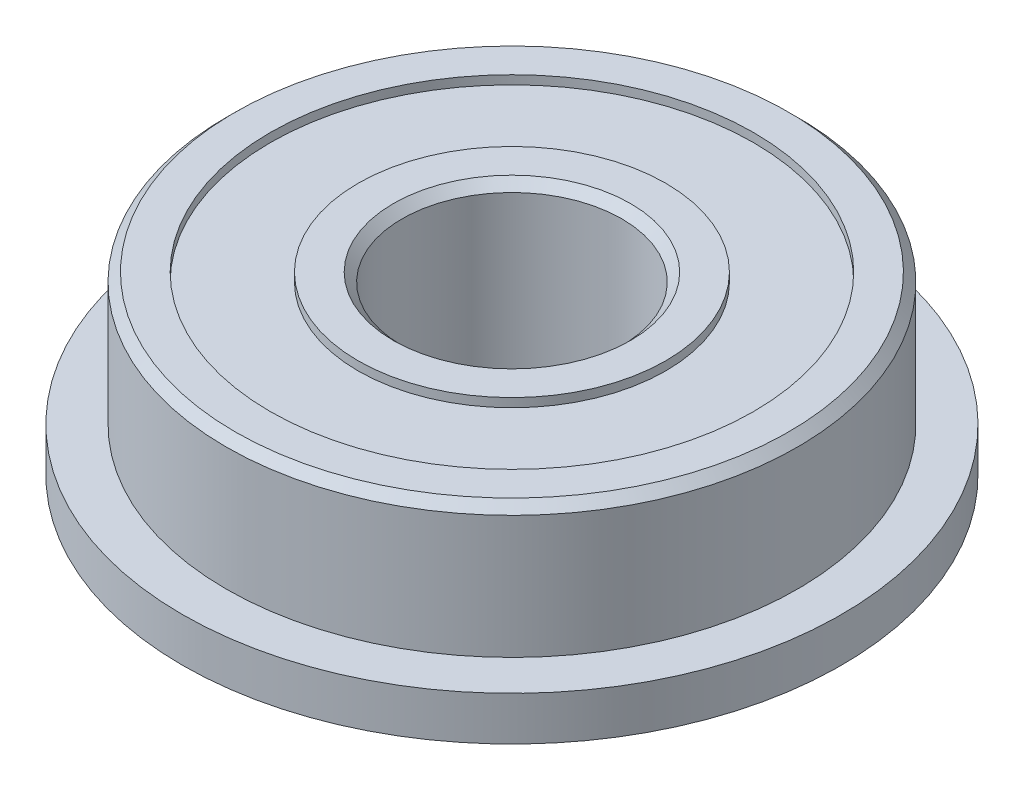
ISO-10303-21;
HEADER;
FILE_DESCRIPTION(('STEP AP214'),'2;1');
FILE_NAME('part.step','',(''),(''),'','','');
FILE_SCHEMA(('AUTOMOTIVE_DESIGN { 1 0 10303 214 1 1 1 1 }'));
ENDSEC;
DATA;
#1=APPLICATION_CONTEXT('core data for automotive mechanical design processes');
#2=APPLICATION_PROTOCOL_DEFINITION('international standard','automotive_design',2000,#1);
#3=PRODUCT_CONTEXT('',#1,'mechanical');
#4=PRODUCT('Part','Part','',(#3));
#5=PRODUCT_RELATED_PRODUCT_CATEGORY('part','',(#4));
#6=PRODUCT_DEFINITION_FORMATION('','',#4);
#7=PRODUCT_DEFINITION_CONTEXT('part definition',#1,'design');
#8=PRODUCT_DEFINITION('design','',#6,#7);
#9=PRODUCT_DEFINITION_SHAPE('','',#8);
#10=(LENGTH_UNIT() NAMED_UNIT(*) SI_UNIT(.MILLI.,.METRE.));
#11=(NAMED_UNIT(*) PLANE_ANGLE_UNIT() SI_UNIT($,.RADIAN.));
#12=(NAMED_UNIT(*) SI_UNIT($,.STERADIAN.) SOLID_ANGLE_UNIT());
#13=UNCERTAINTY_MEASURE_WITH_UNIT(LENGTH_MEASURE(1.E-05),#10,'distance_accuracy_value','');
#14=(GEOMETRIC_REPRESENTATION_CONTEXT(3) GLOBAL_UNCERTAINTY_ASSIGNED_CONTEXT((#13)) GLOBAL_UNIT_ASSIGNED_CONTEXT((#10,
#11,#12)) REPRESENTATION_CONTEXT('',''));
#15=CARTESIAN_POINT('',(0.,0.,0.));
#16=DIRECTION('',(0.,0.,1.));
#17=DIRECTION('',(1.,0.,0.));
#18=AXIS2_PLACEMENT_3D('',#15,#16,#17);
#19=CARTESIAN_POINT('',(-2.5,0.,0.));
#20=DIRECTION('',(0.,-1.,0.));
#21=DIRECTION('',(0.,0.,-1.));
#22=AXIS2_PLACEMENT_3D('',#19,#20,#21);
#23=PLANE('',#22);
#24=CARTESIAN_POINT('',(0.,0.,0.));
#25=DIRECTION('',(0.,-1.,0.));
#26=DIRECTION('',(0.,0.,-1.));
#27=AXIS2_PLACEMENT_3D('',#24,#25,#26);
#28=CIRCLE('',#27,2.7);
#29=CARTESIAN_POINT('',(0.,0.,-2.7));
#30=VERTEX_POINT('',#29);
#31=EDGE_CURVE('E70',#30,#30,#28,.F.);
#32=ORIENTED_EDGE('',*,*,#31,.T.);
#33=EDGE_LOOP('',(#32));
#34=FACE_BOUND('',#33,.T.);
#35=CARTESIAN_POINT('',(0.,0.,0.));
#36=DIRECTION('',(0.,1.,0.));
#37=DIRECTION('',(0.,0.,1.));
#38=AXIS2_PLACEMENT_3D('',#35,#36,#37);
#39=CIRCLE('',#38,3.5);
#40=CARTESIAN_POINT('',(0.,0.,3.5));
#41=VERTEX_POINT('',#40);
#42=EDGE_CURVE('E111',#41,#41,#39,.T.);
#43=ORIENTED_EDGE('',*,*,#42,.F.);
#44=EDGE_LOOP('',(#43));
#45=FACE_BOUND('',#44,.T.);
#46=ADVANCED_FACE('F41',(#34,#45),#23,.T.);
#47=CARTESIAN_POINT('',(-6.5,4.,0.));
#48=DIRECTION('',(0.,1.,0.));
#49=DIRECTION('',(0.,0.,1.));
#50=AXIS2_PLACEMENT_3D('',#47,#48,#49);
#51=PLANE('',#50);
#52=CARTESIAN_POINT('',(0.,4.,0.));
#53=DIRECTION('',(0.,1.,0.));
#54=DIRECTION('',(0.,0.,1.));
#55=AXIS2_PLACEMENT_3D('',#52,#53,#54);
#56=CIRCLE('',#55,2.7);
#57=CARTESIAN_POINT('',(0.,4.,2.7));
#58=VERTEX_POINT('',#57);
#59=EDGE_CURVE('E55',#58,#58,#56,.F.);
#60=ORIENTED_EDGE('',*,*,#59,.T.);
#61=EDGE_LOOP('',(#60));
#62=FACE_BOUND('',#61,.T.);
#63=CARTESIAN_POINT('',(0.,4.,0.));
#64=DIRECTION('',(0.,1.,0.));
#65=DIRECTION('',(0.,0.,1.));
#66=AXIS2_PLACEMENT_3D('',#63,#64,#65);
#67=CIRCLE('',#66,3.5);
#68=CARTESIAN_POINT('',(0.,4.,3.5));
#69=VERTEX_POINT('',#68);
#70=EDGE_CURVE('E95',#69,#69,#67,.T.);
#71=ORIENTED_EDGE('',*,*,#70,.T.);
#72=EDGE_LOOP('',(#71));
#73=FACE_BOUND('',#72,.T.);
#74=ADVANCED_FACE('F130',(#62,#73),#51,.T.);
#75=CARTESIAN_POINT('',(0.,1.92162386661865,0.));
#76=DIRECTION('',(0.,1.,0.));
#77=DIRECTION('',(0.,0.,1.));
#78=AXIS2_PLACEMENT_3D('',#75,#76,#77);
#79=CYLINDRICAL_SURFACE('',#78,6.5);
#80=CARTESIAN_POINT('',(0.,3.8,0.));
#81=DIRECTION('',(0.,1.,0.));
#82=DIRECTION('',(0.,0.,1.));
#83=AXIS2_PLACEMENT_3D('',#80,#81,#82);
#84=CIRCLE('',#83,6.5);
#85=CARTESIAN_POINT('',(0.,3.8,6.5));
#86=VERTEX_POINT('',#85);
#87=EDGE_CURVE('E10',#86,#86,#84,.F.);
#88=ORIENTED_EDGE('',*,*,#87,.T.);
#89=EDGE_LOOP('',(#88));
#90=FACE_BOUND('',#89,.T.);
#91=CARTESIAN_POINT('',(0.,1.,0.));
#92=DIRECTION('',(0.,1.,0.));
#93=DIRECTION('',(0.,0.,1.));
#94=AXIS2_PLACEMENT_3D('',#91,#92,#93);
#95=CIRCLE('',#94,6.5);
#96=CARTESIAN_POINT('',(0.,1.,6.5));
#97=VERTEX_POINT('',#96);
#98=EDGE_CURVE('E82',#97,#97,#95,.T.);
#99=ORIENTED_EDGE('',*,*,#98,.T.);
#100=EDGE_LOOP('',(#99));
#101=FACE_BOUND('',#100,.T.);
#102=ADVANCED_FACE('F137',(#90,#101),#79,.T.);
#103=CARTESIAN_POINT('',(0.,4.,0.));
#104=DIRECTION('',(0.,1.,0.));
#105=DIRECTION('',(0.,0.,1.));
#106=AXIS2_PLACEMENT_3D('',#103,#104,#105);
#107=CIRCLE('',#106,6.3);
#108=CARTESIAN_POINT('',(0.,4.,6.3));
#109=VERTEX_POINT('',#108);
#110=EDGE_CURVE('E50',#109,#109,#107,.T.);
#111=ORIENTED_EDGE('',*,*,#110,.T.);
#112=EDGE_LOOP('',(#111));
#113=FACE_BOUND('',#112,.T.);
#114=CARTESIAN_POINT('',(0.,4.,0.));
#115=DIRECTION('',(0.,1.,0.));
#116=DIRECTION('',(0.,0.,1.));
#117=AXIS2_PLACEMENT_3D('',#114,#115,#116);
#118=CIRCLE('',#117,5.5);
#119=CARTESIAN_POINT('',(0.,4.,5.5));
#120=VERTEX_POINT('',#119);
#121=EDGE_CURVE('E87',#120,#120,#118,.T.);
#122=ORIENTED_EDGE('',*,*,#121,.F.);
#123=EDGE_LOOP('',(#122));
#124=FACE_BOUND('',#123,.T.);
#125=ADVANCED_FACE('F140',(#113,#124),#51,.T.);
#126=CARTESIAN_POINT('',(0.,1.92162386661865,0.));
#127=DIRECTION('',(0.,1.,0.));
#128=DIRECTION('',(0.,0.,1.));
#129=AXIS2_PLACEMENT_3D('',#126,#127,#128);
#130=CYLINDRICAL_SURFACE('',#129,2.5);
#131=CARTESIAN_POINT('',(0.,0.199999999999997,0.));
#132=DIRECTION('',(0.,-1.,0.));
#133=DIRECTION('',(0.,0.,-1.));
#134=AXIS2_PLACEMENT_3D('',#131,#132,#133);
#135=CIRCLE('',#134,2.5);
#136=CARTESIAN_POINT('',(0.,0.199999999999997,-2.5));
#137=VERTEX_POINT('',#136);
#138=EDGE_CURVE('E60',#137,#137,#135,.T.);
#139=ORIENTED_EDGE('',*,*,#138,.T.);
#140=EDGE_LOOP('',(#139));
#141=FACE_BOUND('',#140,.T.);
#142=CARTESIAN_POINT('',(0.,3.8,0.));
#143=DIRECTION('',(0.,1.,0.));
#144=DIRECTION('',(0.,0.,1.));
#145=AXIS2_PLACEMENT_3D('',#142,#143,#144);
#146=CIRCLE('',#145,2.5);
#147=CARTESIAN_POINT('',(0.,3.8,2.5));
#148=VERTEX_POINT('',#147);
#149=EDGE_CURVE('E66',#148,#148,#146,.T.);
#150=ORIENTED_EDGE('',*,*,#149,.T.);
#151=EDGE_LOOP('',(#150));
#152=FACE_BOUND('',#151,.T.);
#153=ADVANCED_FACE('F145',(#141,#152),#130,.F.);
#154=CARTESIAN_POINT('',(0.,0.,0.));
#155=DIRECTION('',(0.,1.,0.));
#156=DIRECTION('',(0.,0.,1.));
#157=AXIS2_PLACEMENT_3D('',#154,#155,#156);
#158=CIRCLE('',#157,5.5);
#159=CARTESIAN_POINT('',(0.,0.,5.5));
#160=VERTEX_POINT('',#159);
#161=EDGE_CURVE('E103',#160,#160,#158,.T.);
#162=ORIENTED_EDGE('',*,*,#161,.T.);
#163=EDGE_LOOP('',(#162));
#164=FACE_BOUND('',#163,.T.);
#165=CARTESIAN_POINT('',(0.,0.,0.));
#166=DIRECTION('',(0.,1.,0.));
#167=DIRECTION('',(0.,0.,1.));
#168=AXIS2_PLACEMENT_3D('',#165,#166,#167);
#169=CIRCLE('',#168,7.5);
#170=CARTESIAN_POINT('',(0.,0.,7.5));
#171=VERTEX_POINT('',#170);
#172=EDGE_CURVE('E74',#171,#171,#169,.T.);
#173=ORIENTED_EDGE('',*,*,#172,.F.);
#174=EDGE_LOOP('',(#173));
#175=FACE_BOUND('',#174,.T.);
#176=ADVANCED_FACE('F133',(#164,#175),#23,.T.);
#177=CARTESIAN_POINT('',(0.,1.92162386661865,0.));
#178=DIRECTION('',(0.,1.,0.));
#179=DIRECTION('',(0.,0.,1.));
#180=AXIS2_PLACEMENT_3D('',#177,#178,#179);
#181=CYLINDRICAL_SURFACE('',#180,7.5);
#182=ORIENTED_EDGE('',*,*,#172,.T.);
#183=EDGE_LOOP('',(#182));
#184=FACE_BOUND('',#183,.T.);
#185=CARTESIAN_POINT('',(0.,0.999999999999999,0.));
#186=DIRECTION('',(0.,1.,0.));
#187=DIRECTION('',(0.,0.,1.));
#188=AXIS2_PLACEMENT_3D('',#185,#186,#187);
#189=CIRCLE('',#188,7.5);
#190=CARTESIAN_POINT('',(0.,0.999999999999999,7.5));
#191=VERTEX_POINT('',#190);
#192=EDGE_CURVE('E78',#191,#191,#189,.T.);
#193=ORIENTED_EDGE('',*,*,#192,.F.);
#194=EDGE_LOOP('',(#193));
#195=FACE_BOUND('',#194,.T.);
#196=ADVANCED_FACE('F144',(#184,#195),#181,.T.);
#197=CARTESIAN_POINT('',(-6.5,1.,0.));
#198=DIRECTION('',(0.,1.,0.));
#199=DIRECTION('',(0.,0.,1.));
#200=AXIS2_PLACEMENT_3D('',#197,#198,#199);
#201=PLANE('',#200);
#202=ORIENTED_EDGE('',*,*,#192,.T.);
#203=EDGE_LOOP('',(#202));
#204=FACE_BOUND('',#203,.T.);
#205=ORIENTED_EDGE('',*,*,#98,.F.);
#206=EDGE_LOOP('',(#205));
#207=FACE_BOUND('',#206,.T.);
#208=ADVANCED_FACE('F151',(#204,#207),#201,.T.);
#209=CARTESIAN_POINT('',(0.,3.8,0.));
#210=DIRECTION('',(0.,1.,0.));
#211=DIRECTION('',(0.,0.,1.));
#212=AXIS2_PLACEMENT_3D('',#209,#210,#211);
#213=CYLINDRICAL_SURFACE('',#212,5.5);
#214=CARTESIAN_POINT('',(0.,3.8,0.));
#215=DIRECTION('',(0.,1.,0.));
#216=DIRECTION('',(0.,0.,1.));
#217=AXIS2_PLACEMENT_3D('',#214,#215,#216);
#218=CIRCLE('',#217,5.5);
#219=CARTESIAN_POINT('',(0.,3.8,5.5));
#220=VERTEX_POINT('',#219);
#221=EDGE_CURVE('E86',#220,#220,#218,.T.);
#222=ORIENTED_EDGE('',*,*,#221,.F.);
#223=EDGE_LOOP('',(#222));
#224=FACE_BOUND('',#223,.T.);
#225=ORIENTED_EDGE('',*,*,#121,.T.);
#226=EDGE_LOOP('',(#225));
#227=FACE_BOUND('',#226,.T.);
#228=ADVANCED_FACE('F162',(#224,#227),#213,.F.);
#229=CARTESIAN_POINT('',(0.,3.8,0.));
#230=DIRECTION('',(0.,1.,0.));
#231=DIRECTION('',(0.,0.,1.));
#232=AXIS2_PLACEMENT_3D('',#229,#230,#231);
#233=PLANE('',#232);
#234=CARTESIAN_POINT('',(0.,3.8,0.));
#235=DIRECTION('',(0.,1.,0.));
#236=DIRECTION('',(0.,0.,1.));
#237=AXIS2_PLACEMENT_3D('',#234,#235,#236);
#238=CIRCLE('',#237,3.5);
#239=CARTESIAN_POINT('',(0.,3.8,3.5));
#240=VERTEX_POINT('',#239);
#241=EDGE_CURVE('E91',#240,#240,#238,.T.);
#242=ORIENTED_EDGE('',*,*,#241,.F.);
#243=EDGE_LOOP('',(#242));
#244=FACE_BOUND('',#243,.T.);
#245=ORIENTED_EDGE('',*,*,#221,.T.);
#246=EDGE_LOOP('',(#245));
#247=FACE_BOUND('',#246,.T.);
#248=ADVANCED_FACE('F196',(#244,#247),#233,.T.);
#249=CARTESIAN_POINT('',(0.,3.8,0.));
#250=DIRECTION('',(0.,1.,0.));
#251=DIRECTION('',(0.,0.,1.));
#252=AXIS2_PLACEMENT_3D('',#249,#250,#251);
#253=CYLINDRICAL_SURFACE('',#252,3.5);
#254=ORIENTED_EDGE('',*,*,#241,.T.);
#255=EDGE_LOOP('',(#254));
#256=FACE_BOUND('',#255,.T.);
#257=ORIENTED_EDGE('',*,*,#70,.F.);
#258=EDGE_LOOP('',(#257));
#259=FACE_BOUND('',#258,.T.);
#260=ADVANCED_FACE('F194',(#256,#259),#253,.T.);
#261=CARTESIAN_POINT('',(0.,0.2,0.));
#262=DIRECTION('',(0.,-1.,0.));
#263=DIRECTION('',(0.,0.,1.));
#264=AXIS2_PLACEMENT_3D('',#261,#262,#263);
#265=PLANE('',#264);
#266=CARTESIAN_POINT('',(0.,0.2,0.));
#267=DIRECTION('',(0.,1.,0.));
#268=DIRECTION('',(0.,0.,1.));
#269=AXIS2_PLACEMENT_3D('',#266,#267,#268);
#270=CIRCLE('',#269,5.5);
#271=CARTESIAN_POINT('',(0.,0.2,5.5));
#272=VERTEX_POINT('',#271);
#273=EDGE_CURVE('E99',#272,#272,#270,.T.);
#274=ORIENTED_EDGE('',*,*,#273,.F.);
#275=EDGE_LOOP('',(#274));
#276=FACE_BOUND('',#275,.T.);
#277=CARTESIAN_POINT('',(0.,0.2,0.));
#278=DIRECTION('',(0.,1.,0.));
#279=DIRECTION('',(0.,0.,1.));
#280=AXIS2_PLACEMENT_3D('',#277,#278,#279);
#281=CIRCLE('',#280,3.5);
#282=CARTESIAN_POINT('',(0.,0.2,3.5));
#283=VERTEX_POINT('',#282);
#284=EDGE_CURVE('E107',#283,#283,#281,.T.);
#285=ORIENTED_EDGE('',*,*,#284,.T.);
#286=EDGE_LOOP('',(#285));
#287=FACE_BOUND('',#286,.T.);
#288=ADVANCED_FACE('F119',(#276,#287),#265,.T.);
#289=CARTESIAN_POINT('',(0.,0.2,0.));
#290=DIRECTION('',(0.,-1.,0.));
#291=DIRECTION('',(0.,0.,-1.));
#292=AXIS2_PLACEMENT_3D('',#289,#290,#291);
#293=CYLINDRICAL_SURFACE('',#292,5.5);
#294=ORIENTED_EDGE('',*,*,#273,.T.);
#295=EDGE_LOOP('',(#294));
#296=FACE_BOUND('',#295,.T.);
#297=ORIENTED_EDGE('',*,*,#161,.F.);
#298=EDGE_LOOP('',(#297));
#299=FACE_BOUND('',#298,.T.);
#300=ADVANCED_FACE('F125',(#296,#299),#293,.F.);
#301=CARTESIAN_POINT('',(0.,0.2,0.));
#302=DIRECTION('',(0.,-1.,0.));
#303=DIRECTION('',(0.,0.,-1.));
#304=AXIS2_PLACEMENT_3D('',#301,#302,#303);
#305=CYLINDRICAL_SURFACE('',#304,3.5);
#306=ORIENTED_EDGE('',*,*,#284,.F.);
#307=EDGE_LOOP('',(#306));
#308=FACE_BOUND('',#307,.T.);
#309=ORIENTED_EDGE('',*,*,#42,.T.);
#310=EDGE_LOOP('',(#309));
#311=FACE_BOUND('',#310,.T.);
#312=ADVANCED_FACE('F121',(#308,#311),#305,.T.);
#313=CARTESIAN_POINT('',(0.,0.,0.));
#314=DIRECTION('',(0.,-1.,0.));
#315=DIRECTION('',(0.,0.,-1.));
#316=AXIS2_PLACEMENT_3D('',#313,#314,#315);
#317=CONICAL_SURFACE('',#316,2.7,0.785398163397447);
#318=ORIENTED_EDGE('',*,*,#138,.F.);
#319=EDGE_LOOP('',(#318));
#320=FACE_BOUND('',#319,.T.);
#321=ORIENTED_EDGE('',*,*,#31,.F.);
#322=EDGE_LOOP('',(#321));
#323=FACE_BOUND('',#322,.T.);
#324=ADVANCED_FACE('F124',(#320,#323),#317,.F.);
#325=CARTESIAN_POINT('',(0.,3.8,0.));
#326=DIRECTION('',(0.,1.,0.));
#327=DIRECTION('',(0.,0.,1.));
#328=AXIS2_PLACEMENT_3D('',#325,#326,#327);
#329=CONICAL_SURFACE('',#328,2.5,0.785398163397445);
#330=ORIENTED_EDGE('',*,*,#59,.F.);
#331=EDGE_LOOP('',(#330));
#332=FACE_BOUND('',#331,.T.);
#333=ORIENTED_EDGE('',*,*,#149,.F.);
#334=EDGE_LOOP('',(#333));
#335=FACE_BOUND('',#334,.T.);
#336=ADVANCED_FACE('F177',(#332,#335),#329,.F.);
#337=CARTESIAN_POINT('',(0.,4.,0.));
#338=DIRECTION('',(0.,-1.,0.));
#339=DIRECTION('',(0.,0.,-1.));
#340=AXIS2_PLACEMENT_3D('',#337,#338,#339);
#341=CONICAL_SURFACE('',#340,6.3,0.78539816339744);
#342=ORIENTED_EDGE('',*,*,#87,.F.);
#343=EDGE_LOOP('',(#342));
#344=FACE_BOUND('',#343,.T.);
#345=ORIENTED_EDGE('',*,*,#110,.F.);
#346=EDGE_LOOP('',(#345));
#347=FACE_BOUND('',#346,.T.);
#348=ADVANCED_FACE('F44',(#344,#347),#341,.T.);
#349=CLOSED_SHELL('',(#46,#74,#102,#125,#153,#176,#196,#208,#228,#248,#260,#288,#300,#312,#324,
#336,#348));
#350=MANIFOLD_SOLID_BREP('B2',#349);
#351=ADVANCED_BREP_SHAPE_REPRESENTATION('',(#18,#350),#14);
#352=SHAPE_DEFINITION_REPRESENTATION(#9,#351);
ENDSEC;
END-ISO-10303-21;
